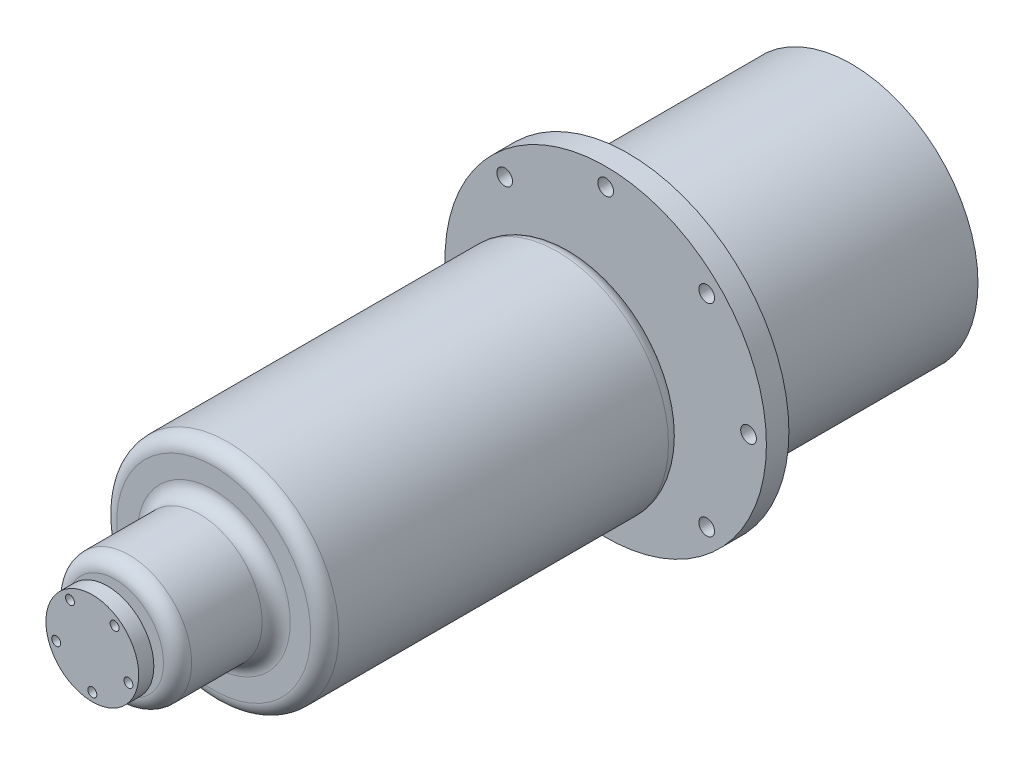
ISO-10303-21;
HEADER;
FILE_DESCRIPTION(('STEP AP214'),'2;1');
FILE_NAME('part.step','',(''),(''),'','','');
FILE_SCHEMA(('AUTOMOTIVE_DESIGN { 1 0 10303 214 1 1 1 1 }'));
ENDSEC;
DATA;
#1=APPLICATION_CONTEXT('core data for automotive mechanical design processes');
#2=APPLICATION_PROTOCOL_DEFINITION('international standard','automotive_design',2000,#1);
#3=PRODUCT_CONTEXT('',#1,'mechanical');
#4=PRODUCT('Part','Part','',(#3));
#5=PRODUCT_RELATED_PRODUCT_CATEGORY('part','',(#4));
#6=PRODUCT_DEFINITION_FORMATION('','',#4);
#7=PRODUCT_DEFINITION_CONTEXT('part definition',#1,'design');
#8=PRODUCT_DEFINITION('design','',#6,#7);
#9=PRODUCT_DEFINITION_SHAPE('','',#8);
#10=(LENGTH_UNIT() NAMED_UNIT(*) SI_UNIT(.MILLI.,.METRE.));
#11=(NAMED_UNIT(*) PLANE_ANGLE_UNIT() SI_UNIT($,.RADIAN.));
#12=(NAMED_UNIT(*) SI_UNIT($,.STERADIAN.) SOLID_ANGLE_UNIT());
#13=UNCERTAINTY_MEASURE_WITH_UNIT(LENGTH_MEASURE(1.E-05),#10,'distance_accuracy_value','');
#14=(GEOMETRIC_REPRESENTATION_CONTEXT(3) GLOBAL_UNCERTAINTY_ASSIGNED_CONTEXT((#13)) GLOBAL_UNIT_ASSIGNED_CONTEXT((#10,
#11,#12)) REPRESENTATION_CONTEXT('',''));
#15=CARTESIAN_POINT('',(0.,0.,0.));
#16=DIRECTION('',(0.,0.,1.));
#17=DIRECTION('',(1.,0.,0.));
#18=AXIS2_PLACEMENT_3D('',#15,#16,#17);
#19=CARTESIAN_POINT('',(0.,0.,-4.));
#20=DIRECTION('',(0.,0.,1.));
#21=DIRECTION('',(1.,0.,0.));
#22=AXIS2_PLACEMENT_3D('',#19,#20,#21);
#23=PLANE('',#22);
#24=CARTESIAN_POINT('',(0.,0.,-4.));
#25=DIRECTION('',(0.,0.,1.));
#26=DIRECTION('',(1.,0.,0.));
#27=AXIS2_PLACEMENT_3D('',#24,#25,#26);
#28=CIRCLE('',#27,57.15);
#29=CARTESIAN_POINT('',(57.15,0.,-4.));
#30=VERTEX_POINT('',#29);
#31=EDGE_CURVE('E65',#30,#30,#28,.T.);
#32=ORIENTED_EDGE('',*,*,#31,.F.);
#33=EDGE_LOOP('',(#32));
#34=FACE_BOUND('',#33,.T.);
#35=CARTESIAN_POINT('',(0.,50.8,-4.));
#36=DIRECTION('',(0.,0.,-1.));
#37=DIRECTION('',(-1.,0.,0.));
#38=AXIS2_PLACEMENT_3D('',#35,#36,#37);
#39=CIRCLE('',#38,2.79);
#40=CARTESIAN_POINT('',(-2.79,50.8,-4.));
#41=VERTEX_POINT('',#40);
#42=EDGE_CURVE('E121',#41,#41,#39,.T.);
#43=ORIENTED_EDGE('',*,*,#42,.F.);
#44=EDGE_LOOP('',(#43));
#45=FACE_BOUND('',#44,.T.);
#46=CARTESIAN_POINT('',(-35.9210244842766,35.9210244842766,-4.));
#47=DIRECTION('',(0.,0.,-1.));
#48=DIRECTION('',(-1.,0.,0.));
#49=AXIS2_PLACEMENT_3D('',#46,#47,#48);
#50=CIRCLE('',#49,2.79);
#51=CARTESIAN_POINT('',(-38.7110244842766,35.9210244842766,-4.));
#52=VERTEX_POINT('',#51);
#53=EDGE_CURVE('E127',#52,#52,#50,.T.);
#54=ORIENTED_EDGE('',*,*,#53,.F.);
#55=EDGE_LOOP('',(#54));
#56=FACE_BOUND('',#55,.T.);
#57=CARTESIAN_POINT('',(-50.8,0.,-4.));
#58=DIRECTION('',(0.,0.,-1.));
#59=DIRECTION('',(-1.,0.,0.));
#60=AXIS2_PLACEMENT_3D('',#57,#58,#59);
#61=CIRCLE('',#60,2.79);
#62=CARTESIAN_POINT('',(-53.59,0.,-4.));
#63=VERTEX_POINT('',#62);
#64=EDGE_CURVE('E133',#63,#63,#61,.T.);
#65=ORIENTED_EDGE('',*,*,#64,.F.);
#66=EDGE_LOOP('',(#65));
#67=FACE_BOUND('',#66,.T.);
#68=CARTESIAN_POINT('',(-35.9210244842765,-35.9210244842767,-4.));
#69=DIRECTION('',(0.,0.,-1.));
#70=DIRECTION('',(-1.,0.,0.));
#71=AXIS2_PLACEMENT_3D('',#68,#69,#70);
#72=CIRCLE('',#71,2.79);
#73=CARTESIAN_POINT('',(-38.7110244842765,-35.9210244842767,-4.));
#74=VERTEX_POINT('',#73);
#75=EDGE_CURVE('E139',#74,#74,#72,.T.);
#76=ORIENTED_EDGE('',*,*,#75,.F.);
#77=EDGE_LOOP('',(#76));
#78=FACE_BOUND('',#77,.T.);
#79=CARTESIAN_POINT('',(0.,-50.8,-4.));
#80=DIRECTION('',(0.,0.,-1.));
#81=DIRECTION('',(-1.,0.,0.));
#82=AXIS2_PLACEMENT_3D('',#79,#80,#81);
#83=CIRCLE('',#82,2.79);
#84=CARTESIAN_POINT('',(-2.79,-50.8,-4.));
#85=VERTEX_POINT('',#84);
#86=EDGE_CURVE('E145',#85,#85,#83,.T.);
#87=ORIENTED_EDGE('',*,*,#86,.F.);
#88=EDGE_LOOP('',(#87));
#89=FACE_BOUND('',#88,.T.);
#90=CARTESIAN_POINT('',(35.9210244842766,-35.9210244842766,-4.));
#91=DIRECTION('',(0.,0.,-1.));
#92=DIRECTION('',(-1.,0.,0.));
#93=AXIS2_PLACEMENT_3D('',#90,#91,#92);
#94=CIRCLE('',#93,2.79);
#95=CARTESIAN_POINT('',(33.1310244842766,-35.9210244842766,-4.));
#96=VERTEX_POINT('',#95);
#97=EDGE_CURVE('E151',#96,#96,#94,.T.);
#98=ORIENTED_EDGE('',*,*,#97,.F.);
#99=EDGE_LOOP('',(#98));
#100=FACE_BOUND('',#99,.T.);
#101=CARTESIAN_POINT('',(50.8,0.,-4.));
#102=DIRECTION('',(0.,0.,-1.));
#103=DIRECTION('',(-1.,0.,0.));
#104=AXIS2_PLACEMENT_3D('',#101,#102,#103);
#105=CIRCLE('',#104,2.79);
#106=CARTESIAN_POINT('',(48.01,0.,-4.));
#107=VERTEX_POINT('',#106);
#108=EDGE_CURVE('E157',#107,#107,#105,.T.);
#109=ORIENTED_EDGE('',*,*,#108,.F.);
#110=EDGE_LOOP('',(#109));
#111=FACE_BOUND('',#110,.T.);
#112=CARTESIAN_POINT('',(35.9210244842766,35.9210244842767,-4.));
#113=DIRECTION('',(0.,0.,-1.));
#114=DIRECTION('',(-1.,0.,0.));
#115=AXIS2_PLACEMENT_3D('',#112,#113,#114);
#116=CIRCLE('',#115,2.79);
#117=CARTESIAN_POINT('',(33.1310244842766,35.9210244842767,-4.));
#118=VERTEX_POINT('',#117);
#119=EDGE_CURVE('E163',#118,#118,#116,.T.);
#120=ORIENTED_EDGE('',*,*,#119,.F.);
#121=EDGE_LOOP('',(#120));
#122=FACE_BOUND('',#121,.T.);
#123=CARTESIAN_POINT('',(0.,0.,-4.));
#124=DIRECTION('',(0.,0.,1.));
#125=DIRECTION('',(1.,0.,0.));
#126=AXIS2_PLACEMENT_3D('',#123,#124,#125);
#127=CIRCLE('',#126,45.);
#128=CARTESIAN_POINT('',(45.,0.,-4.));
#129=VERTEX_POINT('',#128);
#130=EDGE_CURVE('E61',#129,#129,#127,.F.);
#131=ORIENTED_EDGE('',*,*,#130,.F.);
#132=EDGE_LOOP('',(#131));
#133=FACE_BOUND('',#132,.T.);
#134=ADVANCED_FACE('F29',(#34,#45,#56,#67,#78,#89,#100,#111,#122,#133),#23,.F.);
#135=CARTESIAN_POINT('',(0.,0.,178.489496));
#136=DIRECTION('',(0.,0.,1.));
#137=DIRECTION('',(1.,0.,0.));
#138=AXIS2_PLACEMENT_3D('',#135,#136,#137);
#139=PLANE('',#138);
#140=CARTESIAN_POINT('',(0.,0.,178.489496));
#141=DIRECTION('',(0.,0.,1.));
#142=DIRECTION('',(1.,0.,0.));
#143=AXIS2_PLACEMENT_3D('',#140,#141,#142);
#144=CIRCLE('',#143,17.225);
#145=CARTESIAN_POINT('',(17.225,0.,178.489496));
#146=VERTEX_POINT('',#145);
#147=EDGE_CURVE('E58',#146,#146,#144,.T.);
#148=ORIENTED_EDGE('',*,*,#147,.T.);
#149=EDGE_LOOP('',(#148));
#150=FACE_BOUND('',#149,.T.);
#151=CARTESIAN_POINT('',(0.,0.,178.489496));
#152=DIRECTION('',(0.,0.,1.));
#153=DIRECTION('',(1.,0.,0.));
#154=AXIS2_PLACEMENT_3D('',#151,#152,#153);
#155=CIRCLE('',#154,9.525);
#156=CARTESIAN_POINT('',(9.525,0.,178.489496));
#157=VERTEX_POINT('',#156);
#158=EDGE_CURVE('E77',#157,#157,#155,.T.);
#159=ORIENTED_EDGE('',*,*,#158,.F.);
#160=EDGE_LOOP('',(#159));
#161=FACE_BOUND('',#160,.T.);
#162=ADVANCED_FACE('F180',(#150,#161),#139,.T.);
#163=CARTESIAN_POINT('',(0.,0.,143.406));
#164=DIRECTION('',(0.,0.,1.));
#165=DIRECTION('',(1.,0.,0.));
#166=AXIS2_PLACEMENT_3D('',#163,#164,#165);
#167=PLANE('',#166);
#168=CARTESIAN_POINT('',(0.,0.,143.406));
#169=DIRECTION('',(0.,0.,1.));
#170=DIRECTION('',(1.,0.,0.));
#171=AXIS2_PLACEMENT_3D('',#168,#169,#170);
#172=CIRCLE('',#171,27.225);
#173=CARTESIAN_POINT('',(27.225,0.,143.406));
#174=VERTEX_POINT('',#173);
#175=EDGE_CURVE('E44',#174,#174,#172,.F.);
#176=ORIENTED_EDGE('',*,*,#175,.T.);
#177=EDGE_LOOP('',(#176));
#178=FACE_BOUND('',#177,.T.);
#179=CARTESIAN_POINT('',(0.,0.,143.406));
#180=DIRECTION('',(0.,0.,1.));
#181=DIRECTION('',(1.,0.,0.));
#182=AXIS2_PLACEMENT_3D('',#179,#180,#181);
#183=CIRCLE('',#182,34.5);
#184=CARTESIAN_POINT('',(34.5,0.,143.406));
#185=VERTEX_POINT('',#184);
#186=EDGE_CURVE('E49',#185,#185,#183,.T.);
#187=ORIENTED_EDGE('',*,*,#186,.T.);
#188=EDGE_LOOP('',(#187));
#189=FACE_BOUND('',#188,.T.);
#190=ADVANCED_FACE('F186',(#178,#189),#167,.T.);
#191=CARTESIAN_POINT('',(0.,0.,4.));
#192=DIRECTION('',(0.,0.,1.));
#193=DIRECTION('',(1.,0.,0.));
#194=AXIS2_PLACEMENT_3D('',#191,#192,#193);
#195=PLANE('',#194);
#196=CARTESIAN_POINT('',(35.9210244842766,35.9210244842767,4.));
#197=DIRECTION('',(0.,0.,1.));
#198=DIRECTION('',(1.,0.,0.));
#199=AXIS2_PLACEMENT_3D('',#196,#197,#198);
#200=CIRCLE('',#199,2.79);
#201=CARTESIAN_POINT('',(38.7110244842765,35.9210244842767,4.));
#202=VERTEX_POINT('',#201);
#203=EDGE_CURVE('E160',#202,#202,#200,.F.);
#204=ORIENTED_EDGE('',*,*,#203,.T.);
#205=EDGE_LOOP('',(#204));
#206=FACE_BOUND('',#205,.T.);
#207=CARTESIAN_POINT('',(50.8,0.,4.));
#208=DIRECTION('',(0.,0.,1.));
#209=DIRECTION('',(1.,0.,0.));
#210=AXIS2_PLACEMENT_3D('',#207,#208,#209);
#211=CIRCLE('',#210,2.79);
#212=CARTESIAN_POINT('',(53.59,0.,4.));
#213=VERTEX_POINT('',#212);
#214=EDGE_CURVE('E154',#213,#213,#211,.F.);
#215=ORIENTED_EDGE('',*,*,#214,.T.);
#216=EDGE_LOOP('',(#215));
#217=FACE_BOUND('',#216,.T.);
#218=CARTESIAN_POINT('',(35.9210244842766,-35.9210244842766,4.));
#219=DIRECTION('',(0.,0.,1.));
#220=DIRECTION('',(1.,0.,0.));
#221=AXIS2_PLACEMENT_3D('',#218,#219,#220);
#222=CIRCLE('',#221,2.79);
#223=CARTESIAN_POINT('',(38.7110244842766,-35.9210244842766,4.));
#224=VERTEX_POINT('',#223);
#225=EDGE_CURVE('E148',#224,#224,#222,.F.);
#226=ORIENTED_EDGE('',*,*,#225,.T.);
#227=EDGE_LOOP('',(#226));
#228=FACE_BOUND('',#227,.T.);
#229=CARTESIAN_POINT('',(0.,-50.8,4.));
#230=DIRECTION('',(0.,0.,1.));
#231=DIRECTION('',(1.,0.,0.));
#232=AXIS2_PLACEMENT_3D('',#229,#230,#231);
#233=CIRCLE('',#232,2.79);
#234=CARTESIAN_POINT('',(2.79,-50.8,4.));
#235=VERTEX_POINT('',#234);
#236=EDGE_CURVE('E142',#235,#235,#233,.F.);
#237=ORIENTED_EDGE('',*,*,#236,.T.);
#238=EDGE_LOOP('',(#237));
#239=FACE_BOUND('',#238,.T.);
#240=CARTESIAN_POINT('',(-35.9210244842765,-35.9210244842767,4.));
#241=DIRECTION('',(0.,0.,1.));
#242=DIRECTION('',(1.,0.,0.));
#243=AXIS2_PLACEMENT_3D('',#240,#241,#242);
#244=CIRCLE('',#243,2.79);
#245=CARTESIAN_POINT('',(-33.1310244842765,-35.9210244842767,4.));
#246=VERTEX_POINT('',#245);
#247=EDGE_CURVE('E136',#246,#246,#244,.F.);
#248=ORIENTED_EDGE('',*,*,#247,.T.);
#249=EDGE_LOOP('',(#248));
#250=FACE_BOUND('',#249,.T.);
#251=CARTESIAN_POINT('',(-50.8,0.,4.));
#252=DIRECTION('',(0.,0.,1.));
#253=DIRECTION('',(1.,0.,0.));
#254=AXIS2_PLACEMENT_3D('',#251,#252,#253);
#255=CIRCLE('',#254,2.79);
#256=CARTESIAN_POINT('',(-48.01,0.,4.));
#257=VERTEX_POINT('',#256);
#258=EDGE_CURVE('E130',#257,#257,#255,.F.);
#259=ORIENTED_EDGE('',*,*,#258,.T.);
#260=EDGE_LOOP('',(#259));
#261=FACE_BOUND('',#260,.T.);
#262=CARTESIAN_POINT('',(-35.9210244842766,35.9210244842766,4.));
#263=DIRECTION('',(0.,0.,1.));
#264=DIRECTION('',(1.,0.,0.));
#265=AXIS2_PLACEMENT_3D('',#262,#263,#264);
#266=CIRCLE('',#265,2.79);
#267=CARTESIAN_POINT('',(-33.1310244842766,35.9210244842766,4.));
#268=VERTEX_POINT('',#267);
#269=EDGE_CURVE('E124',#268,#268,#266,.F.);
#270=ORIENTED_EDGE('',*,*,#269,.T.);
#271=EDGE_LOOP('',(#270));
#272=FACE_BOUND('',#271,.T.);
#273=CARTESIAN_POINT('',(0.,50.8,4.));
#274=DIRECTION('',(0.,0.,1.));
#275=DIRECTION('',(1.,0.,0.));
#276=AXIS2_PLACEMENT_3D('',#273,#274,#275);
#277=CIRCLE('',#276,2.79);
#278=CARTESIAN_POINT('',(2.79,50.8,4.));
#279=VERTEX_POINT('',#278);
#280=EDGE_CURVE('E116',#279,#279,#277,.F.);
#281=ORIENTED_EDGE('',*,*,#280,.T.);
#282=EDGE_LOOP('',(#281));
#283=FACE_BOUND('',#282,.T.);
#284=CARTESIAN_POINT('',(0.,0.,4.));
#285=DIRECTION('',(0.,0.,1.));
#286=DIRECTION('',(1.,0.,0.));
#287=AXIS2_PLACEMENT_3D('',#284,#285,#286);
#288=CIRCLE('',#287,57.15);
#289=CARTESIAN_POINT('',(57.15,0.,4.));
#290=VERTEX_POINT('',#289);
#291=EDGE_CURVE('E64',#290,#290,#288,.T.);
#292=ORIENTED_EDGE('',*,*,#291,.T.);
#293=EDGE_LOOP('',(#292));
#294=FACE_BOUND('',#293,.T.);
#295=CARTESIAN_POINT('',(0.,0.,4.));
#296=DIRECTION('',(0.,0.,1.));
#297=DIRECTION('',(1.,0.,0.));
#298=AXIS2_PLACEMENT_3D('',#295,#296,#297);
#299=CIRCLE('',#298,7.5);
#300=CARTESIAN_POINT('',(7.5,0.,4.));
#301=VERTEX_POINT('',#300);
#302=EDGE_CURVE('E71',#301,#301,#299,.T.);
#303=ORIENTED_EDGE('',*,*,#302,.F.);
#304=EDGE_LOOP('',(#303));
#305=FACE_BOUND('',#304,.T.);
#306=ADVANCED_FACE('F193',(#206,#217,#228,#239,#250,#261,#272,#283,#294,#305),#195,.T.);
#307=CARTESIAN_POINT('',(0.,0.,4.));
#308=DIRECTION('',(0.,0.,-1.));
#309=DIRECTION('',(-1.,0.,0.));
#310=AXIS2_PLACEMENT_3D('',#307,#308,#309);
#311=CYLINDRICAL_SURFACE('',#310,57.15);
#312=ORIENTED_EDGE('',*,*,#291,.F.);
#313=EDGE_LOOP('',(#312));
#314=FACE_BOUND('',#313,.T.);
#315=ORIENTED_EDGE('',*,*,#31,.T.);
#316=EDGE_LOOP('',(#315));
#317=FACE_BOUND('',#316,.T.);
#318=ADVANCED_FACE('F195',(#314,#317),#311,.T.);
#319=CARTESIAN_POINT('',(0.,0.,16.166));
#320=DIRECTION('',(0.,0.,-1.));
#321=DIRECTION('',(-1.,0.,0.));
#322=AXIS2_PLACEMENT_3D('',#319,#320,#321);
#323=CYLINDRICAL_SURFACE('',#322,7.5);
#324=CARTESIAN_POINT('',(0.,0.,16.166));
#325=DIRECTION('',(0.,0.,1.));
#326=DIRECTION('',(1.,0.,0.));
#327=AXIS2_PLACEMENT_3D('',#324,#325,#326);
#328=CIRCLE('',#327,7.5);
#329=CARTESIAN_POINT('',(7.5,0.,16.166));
#330=VERTEX_POINT('',#329);
#331=EDGE_CURVE('E68',#330,#330,#328,.T.);
#332=ORIENTED_EDGE('',*,*,#331,.F.);
#333=EDGE_LOOP('',(#332));
#334=FACE_BOUND('',#333,.T.);
#335=ORIENTED_EDGE('',*,*,#302,.T.);
#336=EDGE_LOOP('',(#335));
#337=FACE_BOUND('',#336,.T.);
#338=ADVANCED_FACE('F198',(#334,#337),#323,.T.);
#339=CARTESIAN_POINT('',(0.,0.,16.166));
#340=DIRECTION('',(0.,0.,1.));
#341=DIRECTION('',(1.,0.,0.));
#342=AXIS2_PLACEMENT_3D('',#339,#340,#341);
#343=PLANE('',#342);
#344=CARTESIAN_POINT('',(0.,0.,16.166));
#345=DIRECTION('',(0.,0.,1.));
#346=DIRECTION('',(1.,0.,0.));
#347=AXIS2_PLACEMENT_3D('',#344,#345,#346);
#348=CIRCLE('',#347,34.5);
#349=CARTESIAN_POINT('',(34.5,0.,16.166));
#350=VERTEX_POINT('',#349);
#351=EDGE_CURVE('E10',#350,#350,#348,.F.);
#352=ORIENTED_EDGE('',*,*,#351,.T.);
#353=EDGE_LOOP('',(#352));
#354=FACE_BOUND('',#353,.T.);
#355=ORIENTED_EDGE('',*,*,#331,.T.);
#356=EDGE_LOOP('',(#355));
#357=FACE_BOUND('',#356,.T.);
#358=ADVANCED_FACE('F231',(#354,#357),#343,.F.);
#359=CARTESIAN_POINT('',(0.,0.,143.406));
#360=DIRECTION('',(0.,0.,-1.));
#361=DIRECTION('',(-1.,0.,0.));
#362=AXIS2_PLACEMENT_3D('',#359,#360,#361);
#363=CYLINDRICAL_SURFACE('',#362,39.5);
#364=CARTESIAN_POINT('',(0.,0.,21.166));
#365=DIRECTION('',(0.,0.,1.));
#366=DIRECTION('',(1.,0.,0.));
#367=AXIS2_PLACEMENT_3D('',#364,#365,#366);
#368=CIRCLE('',#367,39.5);
#369=CARTESIAN_POINT('',(39.5,0.,21.166));
#370=VERTEX_POINT('',#369);
#371=EDGE_CURVE('E36',#370,#370,#368,.T.);
#372=ORIENTED_EDGE('',*,*,#371,.T.);
#373=EDGE_LOOP('',(#372));
#374=FACE_BOUND('',#373,.T.);
#375=CARTESIAN_POINT('',(0.,0.,138.406));
#376=DIRECTION('',(0.,0.,1.));
#377=DIRECTION('',(1.,0.,0.));
#378=AXIS2_PLACEMENT_3D('',#375,#376,#377);
#379=CIRCLE('',#378,39.5);
#380=CARTESIAN_POINT('',(39.5,0.,138.406));
#381=VERTEX_POINT('',#380);
#382=EDGE_CURVE('E40',#381,#381,#379,.F.);
#383=ORIENTED_EDGE('',*,*,#382,.T.);
#384=EDGE_LOOP('',(#383));
#385=FACE_BOUND('',#384,.T.);
#386=ADVANCED_FACE('F234',(#374,#385),#363,.T.);
#387=CARTESIAN_POINT('',(0.,0.,178.489496));
#388=DIRECTION('',(0.,0.,-1.));
#389=DIRECTION('',(-1.,0.,0.));
#390=AXIS2_PLACEMENT_3D('',#387,#388,#389);
#391=CYLINDRICAL_SURFACE('',#390,22.225);
#392=CARTESIAN_POINT('',(0.,0.,173.489496));
#393=DIRECTION('',(0.,0.,1.));
#394=DIRECTION('',(1.,0.,0.));
#395=AXIS2_PLACEMENT_3D('',#392,#393,#394);
#396=CIRCLE('',#395,22.225);
#397=CARTESIAN_POINT('',(22.225,0.,173.489496));
#398=VERTEX_POINT('',#397);
#399=EDGE_CURVE('E52',#398,#398,#396,.F.);
#400=ORIENTED_EDGE('',*,*,#399,.T.);
#401=EDGE_LOOP('',(#400));
#402=FACE_BOUND('',#401,.T.);
#403=CARTESIAN_POINT('',(0.,0.,148.406));
#404=DIRECTION('',(0.,0.,1.));
#405=DIRECTION('',(1.,0.,0.));
#406=AXIS2_PLACEMENT_3D('',#403,#404,#405);
#407=CIRCLE('',#406,22.225);
#408=CARTESIAN_POINT('',(22.225,0.,148.406));
#409=VERTEX_POINT('',#408);
#410=EDGE_CURVE('E55',#409,#409,#407,.T.);
#411=ORIENTED_EDGE('',*,*,#410,.T.);
#412=EDGE_LOOP('',(#411));
#413=FACE_BOUND('',#412,.T.);
#414=ADVANCED_FACE('F230',(#402,#413),#391,.T.);
#415=CARTESIAN_POINT('',(0.,0.,181.191548));
#416=DIRECTION('',(0.,0.,-1.));
#417=DIRECTION('',(-1.,0.,0.));
#418=AXIS2_PLACEMENT_3D('',#415,#416,#417);
#419=CYLINDRICAL_SURFACE('',#418,9.525);
#420=CARTESIAN_POINT('',(0.,0.,181.191548));
#421=DIRECTION('',(0.,0.,1.));
#422=DIRECTION('',(1.,0.,0.));
#423=AXIS2_PLACEMENT_3D('',#420,#421,#422);
#424=CIRCLE('',#423,9.525);
#425=CARTESIAN_POINT('',(9.525,0.,181.191548));
#426=VERTEX_POINT('',#425);
#427=EDGE_CURVE('E74',#426,#426,#424,.T.);
#428=ORIENTED_EDGE('',*,*,#427,.F.);
#429=EDGE_LOOP('',(#428));
#430=FACE_BOUND('',#429,.T.);
#431=ORIENTED_EDGE('',*,*,#158,.T.);
#432=EDGE_LOOP('',(#431));
#433=FACE_BOUND('',#432,.T.);
#434=ADVANCED_FACE('F262',(#430,#433),#419,.T.);
#435=CARTESIAN_POINT('',(0.,0.,181.191548));
#436=DIRECTION('',(0.,0.,1.));
#437=DIRECTION('',(1.,0.,0.));
#438=AXIS2_PLACEMENT_3D('',#435,#436,#437);
#439=PLANE('',#438);
#440=CARTESIAN_POINT('',(-12.8392629699845,-4.17172942406193,181.191548));
#441=DIRECTION('',(0.,0.,1.));
#442=DIRECTION('',(1.,0.,0.));
#443=AXIS2_PLACEMENT_3D('',#440,#441,#442);
#444=CIRCLE('',#443,1.6);
#445=CARTESIAN_POINT('',(-11.2392629699845,-4.17172942406193,181.191548));
#446=VERTEX_POINT('',#445);
#447=EDGE_CURVE('E110',#446,#446,#444,.T.);
#448=ORIENTED_EDGE('',*,*,#447,.T.);
#449=EDGE_LOOP('',(#448));
#450=FACE_BOUND('',#449,.T.);
#451=CARTESIAN_POINT('',(0.,-13.5,181.191548));
#452=DIRECTION('',(0.,0.,1.));
#453=DIRECTION('',(1.,0.,0.));
#454=AXIS2_PLACEMENT_3D('',#451,#452,#453);
#455=CIRCLE('',#454,1.6);
#456=CARTESIAN_POINT('',(1.6,-13.5,181.191548));
#457=VERTEX_POINT('',#456);
#458=EDGE_CURVE('E104',#457,#457,#455,.T.);
#459=ORIENTED_EDGE('',*,*,#458,.T.);
#460=EDGE_LOOP('',(#459));
#461=FACE_BOUND('',#460,.T.);
#462=CARTESIAN_POINT('',(12.8392629699846,-4.17172942406175,181.191548));
#463=DIRECTION('',(0.,0.,1.));
#464=DIRECTION('',(1.,0.,0.));
#465=AXIS2_PLACEMENT_3D('',#462,#463,#464);
#466=CIRCLE('',#465,1.6);
#467=CARTESIAN_POINT('',(14.4392629699846,-4.17172942406175,181.191548));
#468=VERTEX_POINT('',#467);
#469=EDGE_CURVE('E98',#468,#468,#466,.T.);
#470=ORIENTED_EDGE('',*,*,#469,.T.);
#471=EDGE_LOOP('',(#470));
#472=FACE_BOUND('',#471,.T.);
#473=CARTESIAN_POINT('',(7.93510090594833,10.9217294240618,181.191548));
#474=DIRECTION('',(0.,0.,1.));
#475=DIRECTION('',(1.,0.,0.));
#476=AXIS2_PLACEMENT_3D('',#473,#474,#475);
#477=CIRCLE('',#476,1.6);
#478=CARTESIAN_POINT('',(9.53510090594833,10.9217294240618,181.191548));
#479=VERTEX_POINT('',#478);
#480=EDGE_CURVE('E92',#479,#479,#477,.T.);
#481=ORIENTED_EDGE('',*,*,#480,.T.);
#482=EDGE_LOOP('',(#481));
#483=FACE_BOUND('',#482,.T.);
#484=CARTESIAN_POINT('',(-7.93510090594848,10.9217294240617,181.191548));
#485=DIRECTION('',(0.,0.,1.));
#486=DIRECTION('',(1.,0.,0.));
#487=AXIS2_PLACEMENT_3D('',#484,#485,#486);
#488=CIRCLE('',#487,1.6);
#489=CARTESIAN_POINT('',(-6.33510090594848,10.9217294240617,181.191548));
#490=VERTEX_POINT('',#489);
#491=EDGE_CURVE('E86',#490,#490,#488,.T.);
#492=ORIENTED_EDGE('',*,*,#491,.T.);
#493=EDGE_LOOP('',(#492));
#494=FACE_BOUND('',#493,.T.);
#495=CARTESIAN_POINT('',(0.,0.,181.191548));
#496=DIRECTION('',(0.,0.,1.));
#497=DIRECTION('',(1.,0.,0.));
#498=AXIS2_PLACEMENT_3D('',#495,#496,#497);
#499=CIRCLE('',#498,16.5);
#500=CARTESIAN_POINT('',(16.5,0.,181.191548));
#501=VERTEX_POINT('',#500);
#502=EDGE_CURVE('E83',#501,#501,#499,.T.);
#503=ORIENTED_EDGE('',*,*,#502,.F.);
#504=EDGE_LOOP('',(#503));
#505=FACE_BOUND('',#504,.T.);
#506=ORIENTED_EDGE('',*,*,#427,.T.);
#507=EDGE_LOOP('',(#506));
#508=FACE_BOUND('',#507,.T.);
#509=ADVANCED_FACE('F269',(#450,#461,#472,#483,#494,#505,#508),#439,.F.);
#510=CARTESIAN_POINT('',(0.,0.,186.576348));
#511=DIRECTION('',(0.,0.,-1.));
#512=DIRECTION('',(-1.,0.,0.));
#513=AXIS2_PLACEMENT_3D('',#510,#511,#512);
#514=CYLINDRICAL_SURFACE('',#513,16.5);
#515=CARTESIAN_POINT('',(0.,0.,186.576348));
#516=DIRECTION('',(0.,0.,1.));
#517=DIRECTION('',(1.,0.,0.));
#518=AXIS2_PLACEMENT_3D('',#515,#516,#517);
#519=CIRCLE('',#518,16.5);
#520=CARTESIAN_POINT('',(16.5,0.,186.576348));
#521=VERTEX_POINT('',#520);
#522=EDGE_CURVE('E80',#521,#521,#519,.T.);
#523=ORIENTED_EDGE('',*,*,#522,.F.);
#524=EDGE_LOOP('',(#523));
#525=FACE_BOUND('',#524,.T.);
#526=ORIENTED_EDGE('',*,*,#502,.T.);
#527=EDGE_LOOP('',(#526));
#528=FACE_BOUND('',#527,.T.);
#529=ADVANCED_FACE('F278',(#525,#528),#514,.T.);
#530=CARTESIAN_POINT('',(0.,0.,186.576348));
#531=DIRECTION('',(0.,0.,1.));
#532=DIRECTION('',(1.,0.,0.));
#533=AXIS2_PLACEMENT_3D('',#530,#531,#532);
#534=PLANE('',#533);
#535=CARTESIAN_POINT('',(-12.8392629699845,-4.17172942406193,186.576348));
#536=DIRECTION('',(0.,0.,1.));
#537=DIRECTION('',(1.,0.,0.));
#538=AXIS2_PLACEMENT_3D('',#535,#536,#537);
#539=CIRCLE('',#538,1.6);
#540=CARTESIAN_POINT('',(-11.2392629699845,-4.17172942406193,186.576348));
#541=VERTEX_POINT('',#540);
#542=EDGE_CURVE('E113',#541,#541,#539,.T.);
#543=ORIENTED_EDGE('',*,*,#542,.F.);
#544=EDGE_LOOP('',(#543));
#545=FACE_BOUND('',#544,.T.);
#546=CARTESIAN_POINT('',(0.,-13.5,186.576348));
#547=DIRECTION('',(0.,0.,1.));
#548=DIRECTION('',(1.,0.,0.));
#549=AXIS2_PLACEMENT_3D('',#546,#547,#548);
#550=CIRCLE('',#549,1.6);
#551=CARTESIAN_POINT('',(1.6,-13.5,186.576348));
#552=VERTEX_POINT('',#551);
#553=EDGE_CURVE('E107',#552,#552,#550,.T.);
#554=ORIENTED_EDGE('',*,*,#553,.F.);
#555=EDGE_LOOP('',(#554));
#556=FACE_BOUND('',#555,.T.);
#557=CARTESIAN_POINT('',(12.8392629699846,-4.17172942406175,186.576348));
#558=DIRECTION('',(0.,0.,1.));
#559=DIRECTION('',(1.,0.,0.));
#560=AXIS2_PLACEMENT_3D('',#557,#558,#559);
#561=CIRCLE('',#560,1.6);
#562=CARTESIAN_POINT('',(14.4392629699846,-4.17172942406175,186.576348));
#563=VERTEX_POINT('',#562);
#564=EDGE_CURVE('E101',#563,#563,#561,.T.);
#565=ORIENTED_EDGE('',*,*,#564,.F.);
#566=EDGE_LOOP('',(#565));
#567=FACE_BOUND('',#566,.T.);
#568=CARTESIAN_POINT('',(7.93510090594833,10.9217294240618,186.576348));
#569=DIRECTION('',(0.,0.,1.));
#570=DIRECTION('',(1.,0.,0.));
#571=AXIS2_PLACEMENT_3D('',#568,#569,#570);
#572=CIRCLE('',#571,1.6);
#573=CARTESIAN_POINT('',(9.53510090594833,10.9217294240618,186.576348));
#574=VERTEX_POINT('',#573);
#575=EDGE_CURVE('E95',#574,#574,#572,.T.);
#576=ORIENTED_EDGE('',*,*,#575,.F.);
#577=EDGE_LOOP('',(#576));
#578=FACE_BOUND('',#577,.T.);
#579=CARTESIAN_POINT('',(-7.93510090594848,10.9217294240617,186.576348));
#580=DIRECTION('',(0.,0.,1.));
#581=DIRECTION('',(1.,0.,0.));
#582=AXIS2_PLACEMENT_3D('',#579,#580,#581);
#583=CIRCLE('',#582,1.6);
#584=CARTESIAN_POINT('',(-6.33510090594848,10.9217294240617,186.576348));
#585=VERTEX_POINT('',#584);
#586=EDGE_CURVE('E89',#585,#585,#583,.T.);
#587=ORIENTED_EDGE('',*,*,#586,.F.);
#588=EDGE_LOOP('',(#587));
#589=FACE_BOUND('',#588,.T.);
#590=ORIENTED_EDGE('',*,*,#522,.T.);
#591=EDGE_LOOP('',(#590));
#592=FACE_BOUND('',#591,.T.);
#593=ADVANCED_FACE('F286',(#545,#556,#567,#578,#589,#592),#534,.T.);
#594=CARTESIAN_POINT('',(-7.93510090594848,10.9217294240617,181.191548));
#595=DIRECTION('',(0.,0.,1.));
#596=DIRECTION('',(1.,0.,0.));
#597=AXIS2_PLACEMENT_3D('',#594,#595,#596);
#598=CYLINDRICAL_SURFACE('',#597,1.6);
#599=ORIENTED_EDGE('',*,*,#491,.F.);
#600=EDGE_LOOP('',(#599));
#601=FACE_BOUND('',#600,.T.);
#602=ORIENTED_EDGE('',*,*,#586,.T.);
#603=EDGE_LOOP('',(#602));
#604=FACE_BOUND('',#603,.T.);
#605=ADVANCED_FACE('F293',(#601,#604),#598,.F.);
#606=CARTESIAN_POINT('',(7.93510090594833,10.9217294240618,181.191548));
#607=DIRECTION('',(0.,0.,1.));
#608=DIRECTION('',(1.,0.,0.));
#609=AXIS2_PLACEMENT_3D('',#606,#607,#608);
#610=CYLINDRICAL_SURFACE('',#609,1.6);
#611=ORIENTED_EDGE('',*,*,#480,.F.);
#612=EDGE_LOOP('',(#611));
#613=FACE_BOUND('',#612,.T.);
#614=ORIENTED_EDGE('',*,*,#575,.T.);
#615=EDGE_LOOP('',(#614));
#616=FACE_BOUND('',#615,.T.);
#617=ADVANCED_FACE('F301',(#613,#616),#610,.F.);
#618=CARTESIAN_POINT('',(12.8392629699846,-4.17172942406175,181.191548));
#619=DIRECTION('',(0.,0.,1.));
#620=DIRECTION('',(1.,0.,0.));
#621=AXIS2_PLACEMENT_3D('',#618,#619,#620);
#622=CYLINDRICAL_SURFACE('',#621,1.6);
#623=ORIENTED_EDGE('',*,*,#469,.F.);
#624=EDGE_LOOP('',(#623));
#625=FACE_BOUND('',#624,.T.);
#626=ORIENTED_EDGE('',*,*,#564,.T.);
#627=EDGE_LOOP('',(#626));
#628=FACE_BOUND('',#627,.T.);
#629=ADVANCED_FACE('F309',(#625,#628),#622,.F.);
#630=CARTESIAN_POINT('',(0.,-13.5,181.191548));
#631=DIRECTION('',(0.,0.,1.));
#632=DIRECTION('',(1.,0.,0.));
#633=AXIS2_PLACEMENT_3D('',#630,#631,#632);
#634=CYLINDRICAL_SURFACE('',#633,1.6);
#635=ORIENTED_EDGE('',*,*,#458,.F.);
#636=EDGE_LOOP('',(#635));
#637=FACE_BOUND('',#636,.T.);
#638=ORIENTED_EDGE('',*,*,#553,.T.);
#639=EDGE_LOOP('',(#638));
#640=FACE_BOUND('',#639,.T.);
#641=ADVANCED_FACE('F317',(#637,#640),#634,.F.);
#642=CARTESIAN_POINT('',(-12.8392629699845,-4.17172942406193,181.191548));
#643=DIRECTION('',(0.,0.,1.));
#644=DIRECTION('',(1.,0.,0.));
#645=AXIS2_PLACEMENT_3D('',#642,#643,#644);
#646=CYLINDRICAL_SURFACE('',#645,1.6);
#647=ORIENTED_EDGE('',*,*,#447,.F.);
#648=EDGE_LOOP('',(#647));
#649=FACE_BOUND('',#648,.T.);
#650=ORIENTED_EDGE('',*,*,#542,.T.);
#651=EDGE_LOOP('',(#650));
#652=FACE_BOUND('',#651,.T.);
#653=ADVANCED_FACE('F325',(#649,#652),#646,.F.);
#654=CARTESIAN_POINT('',(0.,50.8,11.8913116780419));
#655=DIRECTION('',(0.,0.,-1.));
#656=DIRECTION('',(-1.,0.,0.));
#657=AXIS2_PLACEMENT_3D('',#654,#655,#656);
#658=CYLINDRICAL_SURFACE('',#657,2.79);
#659=ORIENTED_EDGE('',*,*,#42,.T.);
#660=EDGE_LOOP('',(#659));
#661=FACE_BOUND('',#660,.T.);
#662=ORIENTED_EDGE('',*,*,#280,.F.);
#663=EDGE_LOOP('',(#662));
#664=FACE_BOUND('',#663,.T.);
#665=ADVANCED_FACE('F333',(#661,#664),#658,.F.);
#666=CARTESIAN_POINT('',(-35.9210244842766,35.9210244842766,11.8913116780419));
#667=DIRECTION('',(0.,0.,-1.));
#668=DIRECTION('',(-1.,0.,0.));
#669=AXIS2_PLACEMENT_3D('',#666,#667,#668);
#670=CYLINDRICAL_SURFACE('',#669,2.79);
#671=ORIENTED_EDGE('',*,*,#53,.T.);
#672=EDGE_LOOP('',(#671));
#673=FACE_BOUND('',#672,.T.);
#674=ORIENTED_EDGE('',*,*,#269,.F.);
#675=EDGE_LOOP('',(#674));
#676=FACE_BOUND('',#675,.T.);
#677=ADVANCED_FACE('F342',(#673,#676),#670,.F.);
#678=CARTESIAN_POINT('',(-50.8,0.,11.8913116780419));
#679=DIRECTION('',(0.,0.,-1.));
#680=DIRECTION('',(-1.,0.,0.));
#681=AXIS2_PLACEMENT_3D('',#678,#679,#680);
#682=CYLINDRICAL_SURFACE('',#681,2.79);
#683=ORIENTED_EDGE('',*,*,#64,.T.);
#684=EDGE_LOOP('',(#683));
#685=FACE_BOUND('',#684,.T.);
#686=ORIENTED_EDGE('',*,*,#258,.F.);
#687=EDGE_LOOP('',(#686));
#688=FACE_BOUND('',#687,.T.);
#689=ADVANCED_FACE('F350',(#685,#688),#682,.F.);
#690=CARTESIAN_POINT('',(-35.9210244842765,-35.9210244842767,11.8913116780419));
#691=DIRECTION('',(0.,0.,-1.));
#692=DIRECTION('',(-1.,0.,0.));
#693=AXIS2_PLACEMENT_3D('',#690,#691,#692);
#694=CYLINDRICAL_SURFACE('',#693,2.79);
#695=ORIENTED_EDGE('',*,*,#75,.T.);
#696=EDGE_LOOP('',(#695));
#697=FACE_BOUND('',#696,.T.);
#698=ORIENTED_EDGE('',*,*,#247,.F.);
#699=EDGE_LOOP('',(#698));
#700=FACE_BOUND('',#699,.T.);
#701=ADVANCED_FACE('F358',(#697,#700),#694,.F.);
#702=CARTESIAN_POINT('',(0.,-50.8,11.8913116780419));
#703=DIRECTION('',(0.,0.,-1.));
#704=DIRECTION('',(-1.,0.,0.));
#705=AXIS2_PLACEMENT_3D('',#702,#703,#704);
#706=CYLINDRICAL_SURFACE('',#705,2.79);
#707=ORIENTED_EDGE('',*,*,#86,.T.);
#708=EDGE_LOOP('',(#707));
#709=FACE_BOUND('',#708,.T.);
#710=ORIENTED_EDGE('',*,*,#236,.F.);
#711=EDGE_LOOP('',(#710));
#712=FACE_BOUND('',#711,.T.);
#713=ADVANCED_FACE('F366',(#709,#712),#706,.F.);
#714=CARTESIAN_POINT('',(35.9210244842766,-35.9210244842766,11.8913116780419));
#715=DIRECTION('',(0.,0.,-1.));
#716=DIRECTION('',(-1.,0.,0.));
#717=AXIS2_PLACEMENT_3D('',#714,#715,#716);
#718=CYLINDRICAL_SURFACE('',#717,2.79);
#719=ORIENTED_EDGE('',*,*,#97,.T.);
#720=EDGE_LOOP('',(#719));
#721=FACE_BOUND('',#720,.T.);
#722=ORIENTED_EDGE('',*,*,#225,.F.);
#723=EDGE_LOOP('',(#722));
#724=FACE_BOUND('',#723,.T.);
#725=ADVANCED_FACE('F374',(#721,#724),#718,.F.);
#726=CARTESIAN_POINT('',(50.8,0.,11.8913116780419));
#727=DIRECTION('',(0.,0.,-1.));
#728=DIRECTION('',(-1.,0.,0.));
#729=AXIS2_PLACEMENT_3D('',#726,#727,#728);
#730=CYLINDRICAL_SURFACE('',#729,2.79);
#731=ORIENTED_EDGE('',*,*,#108,.T.);
#732=EDGE_LOOP('',(#731));
#733=FACE_BOUND('',#732,.T.);
#734=ORIENTED_EDGE('',*,*,#214,.F.);
#735=EDGE_LOOP('',(#734));
#736=FACE_BOUND('',#735,.T.);
#737=ADVANCED_FACE('F382',(#733,#736),#730,.F.);
#738=CARTESIAN_POINT('',(35.9210244842766,35.9210244842767,11.8913116780419));
#739=DIRECTION('',(0.,0.,-1.));
#740=DIRECTION('',(-1.,0.,0.));
#741=AXIS2_PLACEMENT_3D('',#738,#739,#740);
#742=CYLINDRICAL_SURFACE('',#741,2.79);
#743=ORIENTED_EDGE('',*,*,#119,.T.);
#744=EDGE_LOOP('',(#743));
#745=FACE_BOUND('',#744,.T.);
#746=ORIENTED_EDGE('',*,*,#203,.F.);
#747=EDGE_LOOP('',(#746));
#748=FACE_BOUND('',#747,.T.);
#749=ADVANCED_FACE('F175',(#745,#748),#742,.F.);
#750=CARTESIAN_POINT('',(0.,0.,-83.4));
#751=DIRECTION('',(0.,0.,1.));
#752=DIRECTION('',(1.,0.,0.));
#753=AXIS2_PLACEMENT_3D('',#750,#751,#752);
#754=CYLINDRICAL_SURFACE('',#753,45.);
#755=CARTESIAN_POINT('',(0.,0.,-83.4));
#756=DIRECTION('',(0.,0.,-1.));
#757=DIRECTION('',(-1.,0.,0.));
#758=AXIS2_PLACEMENT_3D('',#755,#756,#757);
#759=CIRCLE('',#758,45.);
#760=CARTESIAN_POINT('',(-45.,0.,-83.4));
#761=VERTEX_POINT('',#760);
#762=EDGE_CURVE('E166',#761,#761,#759,.T.);
#763=ORIENTED_EDGE('',*,*,#762,.F.);
#764=EDGE_LOOP('',(#763));
#765=FACE_BOUND('',#764,.T.);
#766=ORIENTED_EDGE('',*,*,#130,.T.);
#767=EDGE_LOOP('',(#766));
#768=FACE_BOUND('',#767,.T.);
#769=ADVANCED_FACE('F172',(#765,#768),#754,.T.);
#770=CARTESIAN_POINT('',(0.,0.,-83.4));
#771=DIRECTION('',(0.,0.,-1.));
#772=DIRECTION('',(-1.,0.,0.));
#773=AXIS2_PLACEMENT_3D('',#770,#771,#772);
#774=PLANE('',#773);
#775=ORIENTED_EDGE('',*,*,#762,.T.);
#776=EDGE_LOOP('',(#775));
#777=FACE_BOUND('',#776,.T.);
#778=ADVANCED_FACE('F170',(#777),#774,.T.);
#779=CARTESIAN_POINT('',(0.,0.,173.489496));
#780=DIRECTION('',(0.,0.,1.));
#781=DIRECTION('',(1.,0.,0.));
#782=AXIS2_PLACEMENT_3D('',#779,#780,#781);
#783=TOROIDAL_SURFACE('',#782,17.225,5.);
#784=ORIENTED_EDGE('',*,*,#399,.F.);
#785=EDGE_LOOP('',(#784));
#786=FACE_BOUND('',#785,.T.);
#787=ORIENTED_EDGE('',*,*,#147,.F.);
#788=EDGE_LOOP('',(#787));
#789=FACE_BOUND('',#788,.T.);
#790=ADVANCED_FACE('F200',(#786,#789),#783,.T.);
#791=CARTESIAN_POINT('',(0.,0.,148.406));
#792=DIRECTION('',(0.,0.,1.));
#793=DIRECTION('',(1.,0.,0.));
#794=AXIS2_PLACEMENT_3D('',#791,#792,#793);
#795=TOROIDAL_SURFACE('',#794,27.225,5.);
#796=ORIENTED_EDGE('',*,*,#175,.F.);
#797=EDGE_LOOP('',(#796));
#798=FACE_BOUND('',#797,.T.);
#799=ORIENTED_EDGE('',*,*,#410,.F.);
#800=EDGE_LOOP('',(#799));
#801=FACE_BOUND('',#800,.T.);
#802=ADVANCED_FACE('F203',(#798,#801),#795,.F.);
#803=CARTESIAN_POINT('',(0.,0.,21.166));
#804=DIRECTION('',(0.,0.,1.));
#805=DIRECTION('',(1.,0.,0.));
#806=AXIS2_PLACEMENT_3D('',#803,#804,#805);
#807=TOROIDAL_SURFACE('',#806,34.5,5.);
#808=ORIENTED_EDGE('',*,*,#351,.F.);
#809=EDGE_LOOP('',(#808));
#810=FACE_BOUND('',#809,.T.);
#811=ORIENTED_EDGE('',*,*,#371,.F.);
#812=EDGE_LOOP('',(#811));
#813=FACE_BOUND('',#812,.T.);
#814=ADVANCED_FACE('F206',(#810,#813),#807,.T.);
#815=CARTESIAN_POINT('',(0.,0.,138.406));
#816=DIRECTION('',(0.,0.,1.));
#817=DIRECTION('',(1.,0.,0.));
#818=AXIS2_PLACEMENT_3D('',#815,#816,#817);
#819=TOROIDAL_SURFACE('',#818,34.5,5.);
#820=ORIENTED_EDGE('',*,*,#382,.F.);
#821=EDGE_LOOP('',(#820));
#822=FACE_BOUND('',#821,.T.);
#823=ORIENTED_EDGE('',*,*,#186,.F.);
#824=EDGE_LOOP('',(#823));
#825=FACE_BOUND('',#824,.T.);
#826=ADVANCED_FACE('F31',(#822,#825),#819,.T.);
#827=CLOSED_SHELL('',(#134,#162,#190,#306,#318,#338,#358,#386,#414,#434,#509,#529,#593,#605,
#617,#629,#641,#653,#665,#677,#689,#701,#713,#725,#737,#749,#769,#778,#790,#802,#814,#826));
#828=MANIFOLD_SOLID_BREP('B2',#827);
#829=ADVANCED_BREP_SHAPE_REPRESENTATION('',(#18,#828),#14);
#830=SHAPE_DEFINITION_REPRESENTATION(#9,#829);
ENDSEC;
END-ISO-10303-21;
